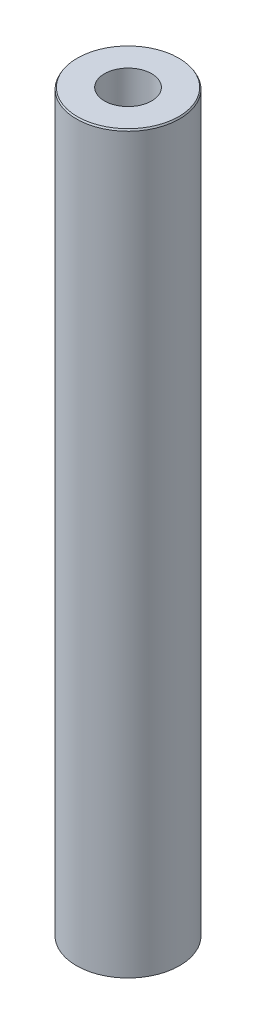
ISO-10303-21;
HEADER;
FILE_DESCRIPTION(('STEP AP214'),'2;1');
FILE_NAME('part.step','',(''),(''),'','','');
FILE_SCHEMA(('AUTOMOTIVE_DESIGN { 1 0 10303 214 1 1 1 1 }'));
ENDSEC;
DATA;
#1=APPLICATION_CONTEXT('core data for automotive mechanical design processes');
#2=APPLICATION_PROTOCOL_DEFINITION('international standard','automotive_design',2000,#1);
#3=PRODUCT_CONTEXT('',#1,'mechanical');
#4=PRODUCT('Part','Part','',(#3));
#5=PRODUCT_RELATED_PRODUCT_CATEGORY('part','',(#4));
#6=PRODUCT_DEFINITION_FORMATION('','',#4);
#7=PRODUCT_DEFINITION_CONTEXT('part definition',#1,'design');
#8=PRODUCT_DEFINITION('design','',#6,#7);
#9=PRODUCT_DEFINITION_SHAPE('','',#8);
#10=(LENGTH_UNIT() NAMED_UNIT(*) SI_UNIT(.MILLI.,.METRE.));
#11=(NAMED_UNIT(*) PLANE_ANGLE_UNIT() SI_UNIT($,.RADIAN.));
#12=(NAMED_UNIT(*) SI_UNIT($,.STERADIAN.) SOLID_ANGLE_UNIT());
#13=UNCERTAINTY_MEASURE_WITH_UNIT(LENGTH_MEASURE(1.E-05),#10,'distance_accuracy_value','');
#14=(GEOMETRIC_REPRESENTATION_CONTEXT(3) GLOBAL_UNCERTAINTY_ASSIGNED_CONTEXT((#13)) GLOBAL_UNIT_ASSIGNED_CONTEXT((#10,
#11,#12)) REPRESENTATION_CONTEXT('',''));
#15=CARTESIAN_POINT('',(0.,0.,0.));
#16=DIRECTION('',(0.,0.,1.));
#17=DIRECTION('',(1.,0.,0.));
#18=AXIS2_PLACEMENT_3D('',#15,#16,#17);
#19=CARTESIAN_POINT('',(0.,391.997729105432,0.));
#20=DIRECTION('',(0.,-1.,0.));
#21=DIRECTION('',(0.,0.,-1.));
#22=AXIS2_PLACEMENT_3D('',#19,#20,#21);
#23=CYLINDRICAL_SURFACE('',#22,27.5);
#24=CARTESIAN_POINT('',(0.,391.157037128004,0.));
#25=DIRECTION('',(0.,1.,0.));
#26=DIRECTION('',(0.,0.,1.));
#27=AXIS2_PLACEMENT_3D('',#24,#25,#26);
#28=CIRCLE('',#27,27.5);
#29=CARTESIAN_POINT('',(0.,391.157037128004,-27.5));
#30=VERTEX_POINT('',#29);
#31=EDGE_CURVE('E50',#30,#30,#28,.F.);
#32=CARTESIAN_POINT('',(0.,0.485373739474049,0.));
#33=DIRECTION('',(0.,1.,0.));
#34=DIRECTION('',(0.,0.,1.));
#35=AXIS2_PLACEMENT_3D('',#32,#33,#34);
#36=CIRCLE('',#35,27.5);
#37=CARTESIAN_POINT('',(0.,0.485373739474049,-27.5));
#38=VERTEX_POINT('',#37);
#39=EDGE_CURVE('E51',#38,#38,#36,.T.);
#40=CARTESIAN_POINT('',(0.,391.157037128004,-27.5));
#41=CARTESIAN_POINT('',(0.,387.087540634374,-27.5));
#42=CARTESIAN_POINT('',(0.,383.018044140743,-27.5));
#43=CARTESIAN_POINT('',(0.,374.879051153482,-27.5));
#44=CARTESIAN_POINT('',(0.,370.809554659852,-27.5));
#45=CARTESIAN_POINT('',(0.,362.670561672591,-27.5));
#46=CARTESIAN_POINT('',(0.,358.60106517896,-27.5));
#47=CARTESIAN_POINT('',(0.,350.462072191699,-27.5));
#48=CARTESIAN_POINT('',(0.,346.392575698068,-27.5));
#49=CARTESIAN_POINT('',(0.,338.253582710807,-27.5));
#50=CARTESIAN_POINT('',(0.,334.184086217177,-27.5));
#51=CARTESIAN_POINT('',(0.,326.045093229916,-27.5));
#52=CARTESIAN_POINT('',(0.,321.975596736285,-27.5));
#53=CARTESIAN_POINT('',(0.,313.836603749024,-27.5));
#54=CARTESIAN_POINT('',(0.,309.767107255394,-27.5));
#55=CARTESIAN_POINT('',(0.,301.628114268133,-27.5));
#56=CARTESIAN_POINT('',(0.,297.558617774502,-27.5));
#57=CARTESIAN_POINT('',(0.,289.419624787241,-27.5));
#58=CARTESIAN_POINT('',(0.,285.350128293611,-27.5));
#59=CARTESIAN_POINT('',(0.,277.211135306349,-27.5));
#60=CARTESIAN_POINT('',(0.,273.141638812719,-27.5));
#61=CARTESIAN_POINT('',(0.,265.002645825458,-27.5));
#62=CARTESIAN_POINT('',(0.,260.933149331827,-27.5));
#63=CARTESIAN_POINT('',(0.,252.794156344566,-27.5));
#64=CARTESIAN_POINT('',(0.,248.724659850936,-27.5));
#65=CARTESIAN_POINT('',(0.,240.585666863675,-27.5));
#66=CARTESIAN_POINT('',(0.,236.516170370044,-27.5));
#67=CARTESIAN_POINT('',(0.,228.377177382783,-27.5));
#68=CARTESIAN_POINT('',(0.,224.307680889153,-27.5));
#69=CARTESIAN_POINT('',(0.,216.168687901892,-27.5));
#70=CARTESIAN_POINT('',(0.,212.099191408261,-27.5));
#71=CARTESIAN_POINT('',(0.,203.960198421,-27.5));
#72=CARTESIAN_POINT('',(0.,199.89070192737,-27.5));
#73=CARTESIAN_POINT('',(0.,191.751708940109,-27.5));
#74=CARTESIAN_POINT('',(0.,187.682212446478,-27.5));
#75=CARTESIAN_POINT('',(0.,179.543219459217,-27.5));
#76=CARTESIAN_POINT('',(0.,175.473722965586,-27.5));
#77=CARTESIAN_POINT('',(0.,167.334729978325,-27.5));
#78=CARTESIAN_POINT('',(0.,163.265233484695,-27.5));
#79=CARTESIAN_POINT('',(0.,155.126240497434,-27.5));
#80=CARTESIAN_POINT('',(0.,151.056744003803,-27.5));
#81=CARTESIAN_POINT('',(0.,142.917751016542,-27.5));
#82=CARTESIAN_POINT('',(0.,138.848254522912,-27.5));
#83=CARTESIAN_POINT('',(0.,130.709261535651,-27.5));
#84=CARTESIAN_POINT('',(0.,126.63976504202,-27.5));
#85=CARTESIAN_POINT('',(0.,118.500772054759,-27.5));
#86=CARTESIAN_POINT('',(0.,114.431275561129,-27.5));
#87=CARTESIAN_POINT('',(0.,106.292282573868,-27.5));
#88=CARTESIAN_POINT('',(0.,102.222786080237,-27.5));
#89=CARTESIAN_POINT('',(0.,94.083793092976,-27.5));
#90=CARTESIAN_POINT('',(0.,90.0142965993455,-27.5));
#91=CARTESIAN_POINT('',(0.,81.8753036120845,-27.5));
#92=CARTESIAN_POINT('',(0.,77.805807118454,-27.5));
#93=CARTESIAN_POINT('',(0.,69.666814131193,-27.5));
#94=CARTESIAN_POINT('',(0.,65.5973176375624,-27.5));
#95=CARTESIAN_POINT('',(0.,57.4583246503014,-27.5));
#96=CARTESIAN_POINT('',(0.,53.3888281566708,-27.5));
#97=CARTESIAN_POINT('',(0.,45.2498351694098,-27.5));
#98=CARTESIAN_POINT('',(0.,41.1803386757792,-27.5));
#99=CARTESIAN_POINT('',(0.,33.0413456885182,-27.5));
#100=CARTESIAN_POINT('',(0.,28.9718491948877,-27.5));
#101=CARTESIAN_POINT('',(0.,20.8328562076267,-27.5));
#102=CARTESIAN_POINT('',(0.,16.7633597139962,-27.5));
#103=CARTESIAN_POINT('',(0.,8.62436672673511,-27.5));
#104=CARTESIAN_POINT('',(0.,4.55487023310457,-27.5));
#105=CARTESIAN_POINT('',(0.,0.485373739474049,-27.5));
#106=B_SPLINE_CURVE_WITH_KNOTS('',3,(#40,#41,#42,#43,#44,#45,#46,#47,#48,#49,#50,#51,#52,#53,
#54,#55,#56,#57,#58,#59,#60,#61,#62,#63,#64,#65,#66,#67,#68,#69,#70,#71,#72,#73,#74,#75,#76,#77,
#78,#79,#80,#81,#82,#83,#84,#85,#86,#87,#88,#89,#90,#91,#92,#93,#94,#95,#96,#97,#98,#99,#100,
#101,#102,#103,#104,#105),.UNSPECIFIED.,.F.,.F.,(4,2,2,2,2,2,2,2,2,2,2,2,2,2,2,2,2,2,2,2,2,2,2,
2,2,2,2,2,2,2,2,2,4),(0.,12.2084894808916,24.4169789617831,36.6254684426747,48.8339579235663,
61.0424474044579,73.2509368853494,85.459426366241,97.6679158471325,109.876405328024,
122.084894808916,134.293384289807,146.501873770699,158.71036325159,170.918852732482,
183.127342213373,195.335831694265,207.544321175157,219.752810656048,231.96130013694,
244.169789617831,256.378279098723,268.586768579614,280.795258060506,293.003747541398,
305.212237022289,317.420726503181,329.629215984072,341.837705464964,354.046194945855,
366.254684426747,378.463173907639,390.67166338853),.UNSPECIFIED.);
#107=EDGE_CURVE('BSEAM39',#30,#38,#106,.T.);
#108=ORIENTED_EDGE('',*,*,#31,.T.);
#109=ORIENTED_EDGE('',*,*,#39,.T.);
#110=ORIENTED_EDGE('',*,*,#107,.T.);
#111=ORIENTED_EDGE('',*,*,#107,.F.);
#112=EDGE_LOOP('',(#108,#110,#109,#111));
#113=FACE_BOUND('',#112,.T.);
#114=ADVANCED_FACE('F39',(#113),#23,.T.);
#115=CARTESIAN_POINT('',(0.,391.997729105432,0.));
#116=DIRECTION('',(0.,1.,0.));
#117=DIRECTION('',(0.,0.,1.));
#118=AXIS2_PLACEMENT_3D('',#115,#116,#117);
#119=PLANE('',#118);
#120=CARTESIAN_POINT('',(0.,391.997729105432,0.));
#121=DIRECTION('',(0.,1.,0.));
#122=DIRECTION('',(0.,0.,1.));
#123=AXIS2_PLACEMENT_3D('',#120,#121,#122);
#124=CIRCLE('',#123,27.0146262605264);
#125=CARTESIAN_POINT('',(0.,391.997729105432,27.0146262605264));
#126=VERTEX_POINT('',#125);
#127=EDGE_CURVE('E54',#126,#126,#124,.T.);
#128=ORIENTED_EDGE('',*,*,#127,.T.);
#129=EDGE_LOOP('',(#128));
#130=FACE_BOUND('',#129,.T.);
#131=CARTESIAN_POINT('',(0.,391.997729105432,0.));
#132=DIRECTION('',(0.,1.,0.));
#133=DIRECTION('',(0.,0.,1.));
#134=AXIS2_PLACEMENT_3D('',#131,#132,#133);
#135=CIRCLE('',#134,12.5857806106657);
#136=CARTESIAN_POINT('',(0.,391.997729105432,-12.5857806106657));
#137=VERTEX_POINT('',#136);
#138=EDGE_CURVE('E58',#137,#137,#135,.T.);
#139=ORIENTED_EDGE('',*,*,#138,.F.);
#140=EDGE_LOOP('',(#139));
#141=FACE_BOUND('',#140,.T.);
#142=ADVANCED_FACE('F69',(#130,#141),#119,.T.);
#143=CARTESIAN_POINT('',(0.,0.,0.));
#144=DIRECTION('',(0.,1.,0.));
#145=DIRECTION('',(0.,0.,1.));
#146=AXIS2_PLACEMENT_3D('',#143,#144,#145);
#147=PLANE('',#146);
#148=CARTESIAN_POINT('',(0.,0.,0.));
#149=DIRECTION('',(0.,1.,0.));
#150=DIRECTION('',(0.,0.,1.));
#151=AXIS2_PLACEMENT_3D('',#148,#149,#150);
#152=CIRCLE('',#151,26.6593080225713);
#153=CARTESIAN_POINT('',(0.,0.,26.6593080225713));
#154=VERTEX_POINT('',#153);
#155=EDGE_CURVE('E10',#154,#154,#152,.F.);
#156=ORIENTED_EDGE('',*,*,#155,.T.);
#157=EDGE_LOOP('',(#156));
#158=FACE_BOUND('',#157,.T.);
#159=CARTESIAN_POINT('',(0.,0.,0.));
#160=DIRECTION('',(0.,1.,0.));
#161=DIRECTION('',(0.,0.,1.));
#162=AXIS2_PLACEMENT_3D('',#159,#160,#161);
#163=CIRCLE('',#162,12.5857806106657);
#164=CARTESIAN_POINT('',(0.,0.,-12.5857806106657));
#165=VERTEX_POINT('',#164);
#166=EDGE_CURVE('E63',#165,#165,#163,.T.);
#167=ORIENTED_EDGE('',*,*,#166,.T.);
#168=EDGE_LOOP('',(#167));
#169=FACE_BOUND('',#168,.T.);
#170=ADVANCED_FACE('F75',(#158,#169),#147,.F.);
#171=CARTESIAN_POINT('',(0.,391.997729105432,0.));
#172=DIRECTION('',(0.,-1.,0.));
#173=DIRECTION('',(0.,0.,-1.));
#174=AXIS2_PLACEMENT_3D('',#171,#172,#173);
#175=CYLINDRICAL_SURFACE('',#174,12.5857806106657);
#176=CARTESIAN_POINT('',(0.,391.997729105432,-12.5857806106657));
#177=CARTESIAN_POINT('',(0.,387.914419427251,-12.5857806106657));
#178=CARTESIAN_POINT('',(0.,383.831109749069,-12.5857806106657));
#179=CARTESIAN_POINT('',(0.,375.664490392706,-12.5857806106657));
#180=CARTESIAN_POINT('',(0.,371.581180714524,-12.5857806106657));
#181=CARTESIAN_POINT('',(0.,363.414561358161,-12.5857806106657));
#182=CARTESIAN_POINT('',(0.,359.331251679979,-12.5857806106657));
#183=CARTESIAN_POINT('',(0.,351.164632323616,-12.5857806106657));
#184=CARTESIAN_POINT('',(0.,347.081322645435,-12.5857806106657));
#185=CARTESIAN_POINT('',(0.,338.914703289072,-12.5857806106657));
#186=CARTESIAN_POINT('',(0.,334.83139361089,-12.5857806106657));
#187=CARTESIAN_POINT('',(0.,326.664774254527,-12.5857806106657));
#188=CARTESIAN_POINT('',(0.,322.581464576345,-12.5857806106657));
#189=CARTESIAN_POINT('',(0.,314.414845219982,-12.5857806106657));
#190=CARTESIAN_POINT('',(0.,310.3315355418,-12.5857806106657));
#191=CARTESIAN_POINT('',(0.,302.164916185437,-12.5857806106657));
#192=CARTESIAN_POINT('',(0.,298.081606507256,-12.5857806106657));
#193=CARTESIAN_POINT('',(0.,289.914987150893,-12.5857806106657));
#194=CARTESIAN_POINT('',(0.,285.831677472711,-12.5857806106657));
#195=CARTESIAN_POINT('',(0.,277.665058116348,-12.5857806106657));
#196=CARTESIAN_POINT('',(0.,273.581748438166,-12.5857806106657));
#197=CARTESIAN_POINT('',(0.,265.415129081803,-12.5857806106657));
#198=CARTESIAN_POINT('',(0.,261.331819403621,-12.5857806106657));
#199=CARTESIAN_POINT('',(0.,253.165200047258,-12.5857806106657));
#200=CARTESIAN_POINT('',(0.,249.081890369077,-12.5857806106657));
#201=CARTESIAN_POINT('',(0.,240.915271012713,-12.5857806106657));
#202=CARTESIAN_POINT('',(0.,236.831961334532,-12.5857806106657));
#203=CARTESIAN_POINT('',(0.,228.665341978169,-12.5857806106657));
#204=CARTESIAN_POINT('',(0.,224.582032299987,-12.5857806106657));
#205=CARTESIAN_POINT('',(0.,216.415412943624,-12.5857806106657));
#206=CARTESIAN_POINT('',(0.,212.332103265442,-12.5857806106657));
#207=CARTESIAN_POINT('',(0.,204.165483909079,-12.5857806106657));
#208=CARTESIAN_POINT('',(0.,200.082174230898,-12.5857806106657));
#209=CARTESIAN_POINT('',(0.,191.915554874534,-12.5857806106657));
#210=CARTESIAN_POINT('',(0.,187.832245196353,-12.5857806106657));
#211=CARTESIAN_POINT('',(0.,179.66562583999,-12.5857806106657));
#212=CARTESIAN_POINT('',(0.,175.582316161808,-12.5857806106657));
#213=CARTESIAN_POINT('',(0.,167.415696805445,-12.5857806106657));
#214=CARTESIAN_POINT('',(0.,163.332387127263,-12.5857806106657));
#215=CARTESIAN_POINT('',(0.,155.1657677709,-12.5857806106657));
#216=CARTESIAN_POINT('',(0.,151.082458092719,-12.5857806106657));
#217=CARTESIAN_POINT('',(0.,142.915838736355,-12.5857806106657));
#218=CARTESIAN_POINT('',(0.,138.832529058174,-12.5857806106657));
#219=CARTESIAN_POINT('',(0.,130.665909701811,-12.5857806106657));
#220=CARTESIAN_POINT('',(0.,126.582600023629,-12.5857806106657));
#221=CARTESIAN_POINT('',(0.,118.415980667266,-12.5857806106657));
#222=CARTESIAN_POINT('',(0.,114.332670989084,-12.5857806106657));
#223=CARTESIAN_POINT('',(0.,106.166051632721,-12.5857806106657));
#224=CARTESIAN_POINT('',(0.,102.08274195454,-12.5857806106657));
#225=CARTESIAN_POINT('',(0.,93.9161225981764,-12.5857806106657));
#226=CARTESIAN_POINT('',(0.,89.8328129199948,-12.5857806106657));
#227=CARTESIAN_POINT('',(0.,81.6661935636317,-12.5857806106657));
#228=CARTESIAN_POINT('',(0.,77.5828838854501,-12.5857806106657));
#229=CARTESIAN_POINT('',(0.,69.4162645290869,-12.5857806106657));
#230=CARTESIAN_POINT('',(0.,65.3329548509053,-12.5857806106657));
#231=CARTESIAN_POINT('',(0.,57.1663354945422,-12.5857806106657));
#232=CARTESIAN_POINT('',(0.,53.0830258163606,-12.5857806106657));
#233=CARTESIAN_POINT('',(0.,44.9164064599974,-12.5857806106657));
#234=CARTESIAN_POINT('',(0.,40.8330967818158,-12.5857806106657));
#235=CARTESIAN_POINT('',(0.,32.6664774254526,-12.5857806106657));
#236=CARTESIAN_POINT('',(0.,28.583167747271,-12.5857806106657));
#237=CARTESIAN_POINT('',(0.,20.4165483909079,-12.5857806106657));
#238=CARTESIAN_POINT('',(0.,16.3332387127263,-12.5857806106657));
#239=CARTESIAN_POINT('',(0.,8.16661935636311,-12.5857806106657));
#240=CARTESIAN_POINT('',(0.,4.08330967818153,-12.5857806106657));
#241=CARTESIAN_POINT('',(0.,0.,-12.5857806106657));
#242=B_SPLINE_CURVE_WITH_KNOTS('',3,(#176,#177,#178,#179,#180,#181,#182,#183,#184,#185,#186,
#187,#188,#189,#190,#191,#192,#193,#194,#195,#196,#197,#198,#199,#200,#201,#202,#203,#204,#205,
#206,#207,#208,#209,#210,#211,#212,#213,#214,#215,#216,#217,#218,#219,#220,#221,#222,#223,#224,
#225,#226,#227,#228,#229,#230,#231,#232,#233,#234,#235,#236,#237,#238,#239,#240,#241),
.UNSPECIFIED.,.F.,.F.,(4,2,2,2,2,2,2,2,2,2,2,2,2,2,2,2,2,2,2,2,2,2,2,2,2,2,2,2,2,2,2,2,4),(0.,
12.2499290345448,24.4998580690896,36.7497871036343,48.9997161381791,61.2496451727238,
73.4995742072686,85.7495032418133,97.9994322763581,110.249361310903,122.499290345448,
134.749219379992,146.999148414537,159.249077449082,171.499006483627,183.748935518171,
195.998864552716,208.248793587261,220.498722621806,232.74865165635,244.998580690895,
257.24850972544,269.498438759985,281.748367794529,293.998296829074,306.248225863619,
318.498154898164,330.748083932708,342.998012967253,355.247942001798,367.497871036343,
379.747800070887,391.997729105432),.UNSPECIFIED.);
#243=EDGE_CURVE('BSEAM70',#137,#165,#242,.T.);
#244=ORIENTED_EDGE('',*,*,#138,.T.);
#245=ORIENTED_EDGE('',*,*,#166,.F.);
#246=ORIENTED_EDGE('',*,*,#243,.T.);
#247=ORIENTED_EDGE('',*,*,#243,.F.);
#248=EDGE_LOOP('',(#244,#246,#245,#247));
#249=FACE_BOUND('',#248,.T.);
#250=ADVANCED_FACE('F70',(#249),#175,.F.);
#251=CARTESIAN_POINT('',(0.,391.997729105432,0.));
#252=DIRECTION('',(0.,-1.,0.));
#253=DIRECTION('',(0.,0.,-1.));
#254=AXIS2_PLACEMENT_3D('',#251,#252,#253);
#255=CONICAL_SURFACE('',#254,27.0146262605264,0.523598775598308);
#256=ORIENTED_EDGE('',*,*,#31,.F.);
#257=EDGE_LOOP('',(#256));
#258=FACE_BOUND('',#257,.T.);
#259=ORIENTED_EDGE('',*,*,#127,.F.);
#260=EDGE_LOOP('',(#259));
#261=FACE_BOUND('',#260,.T.);
#262=ADVANCED_FACE('F81',(#258,#261),#255,.T.);
#263=CARTESIAN_POINT('',(0.,0.485373739474049,0.));
#264=DIRECTION('',(0.,1.,0.));
#265=DIRECTION('',(0.,0.,1.));
#266=AXIS2_PLACEMENT_3D('',#263,#264,#265);
#267=CONICAL_SURFACE('',#266,27.5,1.04719755119659);
#268=ORIENTED_EDGE('',*,*,#155,.F.);
#269=EDGE_LOOP('',(#268));
#270=FACE_BOUND('',#269,.T.);
#271=ORIENTED_EDGE('',*,*,#39,.F.);
#272=EDGE_LOOP('',(#271));
#273=FACE_BOUND('',#272,.T.);
#274=ADVANCED_FACE('F45',(#270,#273),#267,.T.);
#275=CLOSED_SHELL('',(#114,#142,#170,#250,#262,#274));
#276=MANIFOLD_SOLID_BREP('B2',#275);
#277=ADVANCED_BREP_SHAPE_REPRESENTATION('',(#18,#276),#14);
#278=SHAPE_DEFINITION_REPRESENTATION(#9,#277);
ENDSEC;
END-ISO-10303-21;
